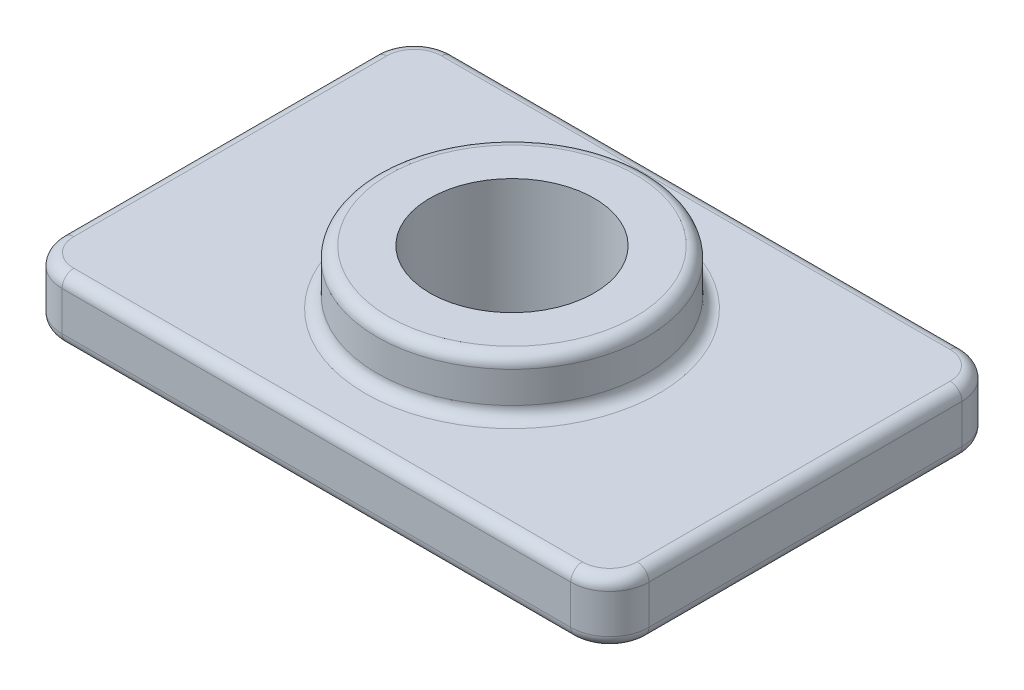
ISO-10303-21;
HEADER;
FILE_DESCRIPTION(('STEP AP214'),'2;1');
FILE_NAME('part.step','',(''),(''),'','','');
FILE_SCHEMA(('AUTOMOTIVE_DESIGN { 1 0 10303 214 1 1 1 1 }'));
ENDSEC;
DATA;
#1=APPLICATION_CONTEXT('core data for automotive mechanical design processes');
#2=APPLICATION_PROTOCOL_DEFINITION('international standard','automotive_design',2000,#1);
#3=PRODUCT_CONTEXT('',#1,'mechanical');
#4=PRODUCT('Part','Part','',(#3));
#5=PRODUCT_RELATED_PRODUCT_CATEGORY('part','',(#4));
#6=PRODUCT_DEFINITION_FORMATION('','',#4);
#7=PRODUCT_DEFINITION_CONTEXT('part definition',#1,'design');
#8=PRODUCT_DEFINITION('design','',#6,#7);
#9=PRODUCT_DEFINITION_SHAPE('','',#8);
#10=(LENGTH_UNIT() NAMED_UNIT(*) SI_UNIT(.MILLI.,.METRE.));
#11=(NAMED_UNIT(*) PLANE_ANGLE_UNIT() SI_UNIT($,.RADIAN.));
#12=(NAMED_UNIT(*) SI_UNIT($,.STERADIAN.) SOLID_ANGLE_UNIT());
#13=UNCERTAINTY_MEASURE_WITH_UNIT(LENGTH_MEASURE(1.E-05),#10,'distance_accuracy_value','');
#14=(GEOMETRIC_REPRESENTATION_CONTEXT(3) GLOBAL_UNCERTAINTY_ASSIGNED_CONTEXT((#13)) GLOBAL_UNIT_ASSIGNED_CONTEXT((#10,
#11,#12)) REPRESENTATION_CONTEXT('',''));
#15=CARTESIAN_POINT('',(0.,0.,0.));
#16=DIRECTION('',(0.,0.,1.));
#17=DIRECTION('',(1.,0.,0.));
#18=AXIS2_PLACEMENT_3D('',#15,#16,#17);
#19=CARTESIAN_POINT('',(1.,1.6,-1.));
#20=DIRECTION('',(0.,1.,0.));
#21=DIRECTION('',(0.,0.,1.));
#22=AXIS2_PLACEMENT_3D('',#19,#20,#21);
#23=PLANE('',#22);
#24=CARTESIAN_POINT('',(7.5,1.6,-5.));
#25=DIRECTION('',(0.,1.,0.));
#26=DIRECTION('',(0.,0.,1.));
#27=AXIS2_PLACEMENT_3D('',#24,#25,#26);
#28=CIRCLE('',#27,3.75);
#29=CARTESIAN_POINT('',(7.5,1.6,-1.25));
#30=VERTEX_POINT('',#29);
#31=EDGE_CURVE('E173',#30,#30,#28,.F.);
#32=ORIENTED_EDGE('',*,*,#31,.T.);
#33=EDGE_LOOP('',(#32));
#34=FACE_BOUND('',#33,.T.);
#35=DIRECTION('',(-1.,0.,0.));
#36=VECTOR('',#35,1.);
#37=CARTESIAN_POINT('',(1.,1.6,-9.7));
#38=LINE('',#37,#36);
#39=CARTESIAN_POINT('',(14.,1.6,-9.7));
#40=VERTEX_POINT('',#39);
#41=CARTESIAN_POINT('',(1.,1.6,-9.7));
#42=VERTEX_POINT('',#41);
#43=EDGE_CURVE('E171',#40,#42,#38,.T.);
#44=ORIENTED_EDGE('',*,*,#43,.T.);
#45=CARTESIAN_POINT('',(1.,1.6,-9.));
#46=DIRECTION('',(0.,1.,0.));
#47=DIRECTION('',(0.,0.,1.));
#48=AXIS2_PLACEMENT_3D('',#45,#46,#47);
#49=CIRCLE('',#48,0.7);
#50=CARTESIAN_POINT('',(0.3,1.6,-9.));
#51=VERTEX_POINT('',#50);
#52=EDGE_CURVE('E153',#42,#51,#49,.T.);
#53=ORIENTED_EDGE('',*,*,#52,.T.);
#54=DIRECTION('',(0.,0.,1.));
#55=VECTOR('',#54,1.);
#56=CARTESIAN_POINT('',(0.3,1.6,-1.));
#57=LINE('',#56,#55);
#58=CARTESIAN_POINT('',(0.3,1.6,-1.));
#59=VERTEX_POINT('',#58);
#60=EDGE_CURVE('E161',#51,#59,#57,.T.);
#61=ORIENTED_EDGE('',*,*,#60,.T.);
#62=CARTESIAN_POINT('',(1.,1.6,-1.));
#63=DIRECTION('',(0.,1.,0.));
#64=DIRECTION('',(0.,0.,1.));
#65=AXIS2_PLACEMENT_3D('',#62,#63,#64);
#66=CIRCLE('',#65,0.7);
#67=CARTESIAN_POINT('',(1.,1.6,-0.3));
#68=VERTEX_POINT('',#67);
#69=EDGE_CURVE('E167',#59,#68,#66,.T.);
#70=ORIENTED_EDGE('',*,*,#69,.T.);
#71=DIRECTION('',(1.,0.,0.));
#72=VECTOR('',#71,1.);
#73=CARTESIAN_POINT('',(14.,1.6,-0.3));
#74=LINE('',#73,#72);
#75=CARTESIAN_POINT('',(14.,1.6,-0.3));
#76=VERTEX_POINT('',#75);
#77=EDGE_CURVE('E324',#68,#76,#74,.T.);
#78=ORIENTED_EDGE('',*,*,#77,.T.);
#79=CARTESIAN_POINT('',(14.,1.6,-1.));
#80=DIRECTION('',(0.,1.,0.));
#81=DIRECTION('',(0.,0.,1.));
#82=AXIS2_PLACEMENT_3D('',#79,#80,#81);
#83=CIRCLE('',#82,0.700000000000001);
#84=CARTESIAN_POINT('',(14.7,1.6,-1.));
#85=VERTEX_POINT('',#84);
#86=EDGE_CURVE('E326',#76,#85,#83,.T.);
#87=ORIENTED_EDGE('',*,*,#86,.T.);
#88=DIRECTION('',(0.,0.,-1.));
#89=VECTOR('',#88,1.);
#90=CARTESIAN_POINT('',(14.7,1.6,-9.));
#91=LINE('',#90,#89);
#92=CARTESIAN_POINT('',(14.7,1.6,-9.));
#93=VERTEX_POINT('',#92);
#94=EDGE_CURVE('E328',#85,#93,#91,.T.);
#95=ORIENTED_EDGE('',*,*,#94,.T.);
#96=CARTESIAN_POINT('',(14.,1.6,-9.));
#97=DIRECTION('',(0.,1.,0.));
#98=DIRECTION('',(0.,0.,1.));
#99=AXIS2_PLACEMENT_3D('',#96,#97,#98);
#100=CIRCLE('',#99,0.7);
#101=EDGE_CURVE('E178',#93,#40,#100,.T.);
#102=ORIENTED_EDGE('',*,*,#101,.T.);
#103=EDGE_LOOP('',(#44,#53,#61,#70,#78,#87,#95,#102));
#104=FACE_BOUND('',#103,.T.);
#105=ADVANCED_FACE('F32',(#34,#104),#23,.T.);
#106=CARTESIAN_POINT('',(1.,1.6,-1.));
#107=DIRECTION('',(0.,-1.,0.));
#108=DIRECTION('',(0.,0.,-1.));
#109=AXIS2_PLACEMENT_3D('',#106,#107,#108);
#110=CYLINDRICAL_SURFACE('',#109,1.);
#111=DIRECTION('',(0.,-1.,0.));
#112=VECTOR('',#111,1.);
#113=CARTESIAN_POINT('',(1.,1.6,0.));
#114=LINE('',#113,#112);
#115=CARTESIAN_POINT('',(1.,1.3,0.));
#116=VERTEX_POINT('',#115);
#117=CARTESIAN_POINT('',(1.,0.3,0.));
#118=VERTEX_POINT('',#117);
#119=EDGE_CURVE('E168',#116,#118,#114,.T.);
#120=ORIENTED_EDGE('',*,*,#119,.F.);
#121=CARTESIAN_POINT('',(1.,1.3,-1.));
#122=DIRECTION('',(0.,1.,0.));
#123=DIRECTION('',(0.,0.,1.));
#124=AXIS2_PLACEMENT_3D('',#121,#122,#123);
#125=CIRCLE('',#124,1.);
#126=CARTESIAN_POINT('',(0.,1.3,-1.));
#127=VERTEX_POINT('',#126);
#128=EDGE_CURVE('E207',#116,#127,#125,.F.);
#129=ORIENTED_EDGE('',*,*,#128,.T.);
#130=DIRECTION('',(0.,-1.,0.));
#131=VECTOR('',#130,1.);
#132=CARTESIAN_POINT('',(0.,1.6,-1.));
#133=LINE('',#132,#131);
#134=CARTESIAN_POINT('',(0.,0.3,-1.));
#135=VERTEX_POINT('',#134);
#136=EDGE_CURVE('E309',#127,#135,#133,.T.);
#137=ORIENTED_EDGE('',*,*,#136,.T.);
#138=CARTESIAN_POINT('',(1.,0.3,-1.));
#139=DIRECTION('',(0.,1.,0.));
#140=DIRECTION('',(0.,0.,1.));
#141=AXIS2_PLACEMENT_3D('',#138,#139,#140);
#142=CIRCLE('',#141,1.);
#143=EDGE_CURVE('E205',#135,#118,#142,.T.);
#144=ORIENTED_EDGE('',*,*,#143,.T.);
#145=EDGE_LOOP('',(#120,#129,#137,#144));
#146=FACE_BOUND('',#145,.T.);
#147=ADVANCED_FACE('F378',(#146),#110,.T.);
#148=CARTESIAN_POINT('',(1.,1.6,0.));
#149=DIRECTION('',(0.,0.,-1.));
#150=DIRECTION('',(-1.,0.,0.));
#151=AXIS2_PLACEMENT_3D('',#148,#149,#150);
#152=PLANE('',#151);
#153=DIRECTION('',(0.,-1.,0.));
#154=VECTOR('',#153,1.);
#155=CARTESIAN_POINT('',(14.,1.6,0.));
#156=LINE('',#155,#154);
#157=CARTESIAN_POINT('',(14.,1.3,0.));
#158=VERTEX_POINT('',#157);
#159=CARTESIAN_POINT('',(14.,0.3,0.));
#160=VERTEX_POINT('',#159);
#161=EDGE_CURVE('E318',#158,#160,#156,.T.);
#162=ORIENTED_EDGE('',*,*,#161,.F.);
#163=DIRECTION('',(1.,0.,0.));
#164=VECTOR('',#163,1.);
#165=CARTESIAN_POINT('',(1.,1.3,0.));
#166=LINE('',#165,#164);
#167=EDGE_CURVE('E203',#158,#116,#166,.F.);
#168=ORIENTED_EDGE('',*,*,#167,.T.);
#169=ORIENTED_EDGE('',*,*,#119,.T.);
#170=DIRECTION('',(1.,0.,0.));
#171=VECTOR('',#170,1.);
#172=CARTESIAN_POINT('',(1.,0.3,0.));
#173=LINE('',#172,#171);
#174=EDGE_CURVE('E201',#118,#160,#173,.T.);
#175=ORIENTED_EDGE('',*,*,#174,.T.);
#176=EDGE_LOOP('',(#162,#168,#169,#175));
#177=FACE_BOUND('',#176,.T.);
#178=ADVANCED_FACE('F359',(#177),#152,.F.);
#179=CARTESIAN_POINT('',(14.,1.6,-1.));
#180=DIRECTION('',(0.,-1.,0.));
#181=DIRECTION('',(0.,0.,-1.));
#182=AXIS2_PLACEMENT_3D('',#179,#180,#181);
#183=CYLINDRICAL_SURFACE('',#182,1.);
#184=DIRECTION('',(0.,-1.,0.));
#185=VECTOR('',#184,1.);
#186=CARTESIAN_POINT('',(15.,1.6,-1.));
#187=LINE('',#186,#185);
#188=CARTESIAN_POINT('',(15.,1.3,-1.));
#189=VERTEX_POINT('',#188);
#190=CARTESIAN_POINT('',(15.,0.3,-1.));
#191=VERTEX_POINT('',#190);
#192=EDGE_CURVE('E315',#189,#191,#187,.T.);
#193=ORIENTED_EDGE('',*,*,#192,.F.);
#194=CARTESIAN_POINT('',(14.,1.3,-1.));
#195=DIRECTION('',(0.,1.,0.));
#196=DIRECTION('',(0.,0.,1.));
#197=AXIS2_PLACEMENT_3D('',#194,#195,#196);
#198=CIRCLE('',#197,1.);
#199=EDGE_CURVE('E199',#189,#158,#198,.F.);
#200=ORIENTED_EDGE('',*,*,#199,.T.);
#201=ORIENTED_EDGE('',*,*,#161,.T.);
#202=CARTESIAN_POINT('',(14.,0.3,-1.));
#203=DIRECTION('',(0.,1.,0.));
#204=DIRECTION('',(0.,0.,1.));
#205=AXIS2_PLACEMENT_3D('',#202,#203,#204);
#206=CIRCLE('',#205,1.);
#207=EDGE_CURVE('E197',#160,#191,#206,.T.);
#208=ORIENTED_EDGE('',*,*,#207,.T.);
#209=EDGE_LOOP('',(#193,#200,#201,#208));
#210=FACE_BOUND('',#209,.T.);
#211=ADVANCED_FACE('F357',(#210),#183,.T.);
#212=CARTESIAN_POINT('',(15.,1.6,-1.));
#213=DIRECTION('',(-1.,0.,0.));
#214=DIRECTION('',(0.,0.,1.));
#215=AXIS2_PLACEMENT_3D('',#212,#213,#214);
#216=PLANE('',#215);
#217=DIRECTION('',(0.,-1.,0.));
#218=VECTOR('',#217,1.);
#219=CARTESIAN_POINT('',(15.,1.6,-9.));
#220=LINE('',#219,#218);
#221=CARTESIAN_POINT('',(15.,1.3,-9.));
#222=VERTEX_POINT('',#221);
#223=CARTESIAN_POINT('',(15.,0.3,-9.));
#224=VERTEX_POINT('',#223);
#225=EDGE_CURVE('E307',#222,#224,#220,.T.);
#226=ORIENTED_EDGE('',*,*,#225,.F.);
#227=DIRECTION('',(0.,0.,-1.));
#228=VECTOR('',#227,1.);
#229=CARTESIAN_POINT('',(15.,1.3,-1.));
#230=LINE('',#229,#228);
#231=EDGE_CURVE('E195',#222,#189,#230,.F.);
#232=ORIENTED_EDGE('',*,*,#231,.T.);
#233=ORIENTED_EDGE('',*,*,#192,.T.);
#234=DIRECTION('',(0.,0.,-1.));
#235=VECTOR('',#234,1.);
#236=CARTESIAN_POINT('',(15.,0.3,-1.));
#237=LINE('',#236,#235);
#238=EDGE_CURVE('E193',#191,#224,#237,.T.);
#239=ORIENTED_EDGE('',*,*,#238,.T.);
#240=EDGE_LOOP('',(#226,#232,#233,#239));
#241=FACE_BOUND('',#240,.T.);
#242=ADVANCED_FACE('F344',(#241),#216,.F.);
#243=CARTESIAN_POINT('',(14.,1.6,-9.));
#244=DIRECTION('',(0.,-1.,0.));
#245=DIRECTION('',(0.,0.,-1.));
#246=AXIS2_PLACEMENT_3D('',#243,#244,#245);
#247=CYLINDRICAL_SURFACE('',#246,1.);
#248=DIRECTION('',(0.,-1.,0.));
#249=VECTOR('',#248,1.);
#250=CARTESIAN_POINT('',(14.,1.6,-10.));
#251=LINE('',#250,#249);
#252=CARTESIAN_POINT('',(14.,1.3,-10.));
#253=VERTEX_POINT('',#252);
#254=CARTESIAN_POINT('',(14.,0.3,-10.));
#255=VERTEX_POINT('',#254);
#256=EDGE_CURVE('E300',#253,#255,#251,.T.);
#257=ORIENTED_EDGE('',*,*,#256,.F.);
#258=CARTESIAN_POINT('',(14.,1.3,-9.));
#259=DIRECTION('',(0.,1.,0.));
#260=DIRECTION('',(0.,0.,1.));
#261=AXIS2_PLACEMENT_3D('',#258,#259,#260);
#262=CIRCLE('',#261,1.);
#263=EDGE_CURVE('E191',#253,#222,#262,.F.);
#264=ORIENTED_EDGE('',*,*,#263,.T.);
#265=ORIENTED_EDGE('',*,*,#225,.T.);
#266=CARTESIAN_POINT('',(14.,0.3,-9.));
#267=DIRECTION('',(0.,1.,0.));
#268=DIRECTION('',(0.,0.,1.));
#269=AXIS2_PLACEMENT_3D('',#266,#267,#268);
#270=CIRCLE('',#269,1.);
#271=EDGE_CURVE('E189',#224,#255,#270,.T.);
#272=ORIENTED_EDGE('',*,*,#271,.T.);
#273=EDGE_LOOP('',(#257,#264,#265,#272));
#274=FACE_BOUND('',#273,.T.);
#275=ADVANCED_FACE('F340',(#274),#247,.T.);
#276=CARTESIAN_POINT('',(1.,1.6,-10.));
#277=DIRECTION('',(0.,0.,1.));
#278=DIRECTION('',(1.,0.,0.));
#279=AXIS2_PLACEMENT_3D('',#276,#277,#278);
#280=PLANE('',#279);
#281=DIRECTION('',(0.,-1.,0.));
#282=VECTOR('',#281,1.);
#283=CARTESIAN_POINT('',(1.,1.6,-10.));
#284=LINE('',#283,#282);
#285=CARTESIAN_POINT('',(1.,1.3,-10.));
#286=VERTEX_POINT('',#285);
#287=CARTESIAN_POINT('',(1.,0.3,-10.));
#288=VERTEX_POINT('',#287);
#289=EDGE_CURVE('E298',#286,#288,#284,.T.);
#290=ORIENTED_EDGE('',*,*,#289,.F.);
#291=DIRECTION('',(-1.,0.,0.));
#292=VECTOR('',#291,1.);
#293=CARTESIAN_POINT('',(14.,1.3,-10.));
#294=LINE('',#293,#292);
#295=EDGE_CURVE('E187',#286,#253,#294,.F.);
#296=ORIENTED_EDGE('',*,*,#295,.T.);
#297=ORIENTED_EDGE('',*,*,#256,.T.);
#298=DIRECTION('',(-1.,0.,0.));
#299=VECTOR('',#298,1.);
#300=CARTESIAN_POINT('',(1.,0.3,-10.));
#301=LINE('',#300,#299);
#302=EDGE_CURVE('E185',#255,#288,#301,.T.);
#303=ORIENTED_EDGE('',*,*,#302,.T.);
#304=EDGE_LOOP('',(#290,#296,#297,#303));
#305=FACE_BOUND('',#304,.T.);
#306=ADVANCED_FACE('F297',(#305),#280,.F.);
#307=CARTESIAN_POINT('',(1.,1.6,-9.));
#308=DIRECTION('',(0.,-1.,0.));
#309=DIRECTION('',(0.,0.,-1.));
#310=AXIS2_PLACEMENT_3D('',#307,#308,#309);
#311=CYLINDRICAL_SURFACE('',#310,1.);
#312=DIRECTION('',(0.,-1.,0.));
#313=VECTOR('',#312,1.);
#314=CARTESIAN_POINT('',(0.,1.6,-9.));
#315=LINE('',#314,#313);
#316=CARTESIAN_POINT('',(0.,1.3,-9.));
#317=VERTEX_POINT('',#316);
#318=CARTESIAN_POINT('',(0.,0.3,-9.));
#319=VERTEX_POINT('',#318);
#320=EDGE_CURVE('E305',#317,#319,#315,.T.);
#321=ORIENTED_EDGE('',*,*,#320,.F.);
#322=CARTESIAN_POINT('',(1.,1.3,-9.));
#323=DIRECTION('',(0.,1.,0.));
#324=DIRECTION('',(0.,0.,1.));
#325=AXIS2_PLACEMENT_3D('',#322,#323,#324);
#326=CIRCLE('',#325,1.);
#327=EDGE_CURVE('E155',#317,#286,#326,.F.);
#328=ORIENTED_EDGE('',*,*,#327,.T.);
#329=ORIENTED_EDGE('',*,*,#289,.T.);
#330=CARTESIAN_POINT('',(1.,0.3,-9.));
#331=DIRECTION('',(0.,1.,0.));
#332=DIRECTION('',(0.,0.,1.));
#333=AXIS2_PLACEMENT_3D('',#330,#331,#332);
#334=CIRCLE('',#333,1.);
#335=EDGE_CURVE('E176',#288,#319,#334,.T.);
#336=ORIENTED_EDGE('',*,*,#335,.T.);
#337=EDGE_LOOP('',(#321,#328,#329,#336));
#338=FACE_BOUND('',#337,.T.);
#339=ADVANCED_FACE('F303',(#338),#311,.T.);
#340=CARTESIAN_POINT('',(0.,1.6,-1.));
#341=DIRECTION('',(1.,0.,0.));
#342=DIRECTION('',(0.,0.,-1.));
#343=AXIS2_PLACEMENT_3D('',#340,#341,#342);
#344=PLANE('',#343);
#345=ORIENTED_EDGE('',*,*,#136,.F.);
#346=DIRECTION('',(0.,0.,1.));
#347=VECTOR('',#346,1.);
#348=CARTESIAN_POINT('',(0.,1.3,-9.));
#349=LINE('',#348,#347);
#350=EDGE_CURVE('E11',#127,#317,#349,.F.);
#351=ORIENTED_EDGE('',*,*,#350,.T.);
#352=ORIENTED_EDGE('',*,*,#320,.T.);
#353=DIRECTION('',(0.,0.,1.));
#354=VECTOR('',#353,1.);
#355=CARTESIAN_POINT('',(0.,0.3,-1.));
#356=LINE('',#355,#354);
#357=EDGE_CURVE('E41',#319,#135,#356,.T.);
#358=ORIENTED_EDGE('',*,*,#357,.T.);
#359=EDGE_LOOP('',(#345,#351,#352,#358));
#360=FACE_BOUND('',#359,.T.);
#361=ADVANCED_FACE('F376',(#360),#344,.F.);
#362=CARTESIAN_POINT('',(1.,0.,-1.));
#363=DIRECTION('',(0.,1.,0.));
#364=DIRECTION('',(0.,0.,1.));
#365=AXIS2_PLACEMENT_3D('',#362,#363,#364);
#366=PLANE('',#365);
#367=DIRECTION('',(0.,0.,1.));
#368=VECTOR('',#367,1.);
#369=CARTESIAN_POINT('',(0.3,0.,-1.));
#370=LINE('',#369,#368);
#371=CARTESIAN_POINT('',(0.3,0.,-1.));
#372=VERTEX_POINT('',#371);
#373=CARTESIAN_POINT('',(0.3,0.,-9.));
#374=VERTEX_POINT('',#373);
#375=EDGE_CURVE('E209',#372,#374,#370,.F.);
#376=ORIENTED_EDGE('',*,*,#375,.T.);
#377=CARTESIAN_POINT('',(1.,0.,-9.));
#378=DIRECTION('',(0.,1.,0.));
#379=DIRECTION('',(0.,0.,1.));
#380=AXIS2_PLACEMENT_3D('',#377,#378,#379);
#381=CIRCLE('',#380,0.7);
#382=CARTESIAN_POINT('',(1.,0.,-9.7));
#383=VERTEX_POINT('',#382);
#384=EDGE_CURVE('E222',#374,#383,#381,.F.);
#385=ORIENTED_EDGE('',*,*,#384,.T.);
#386=DIRECTION('',(-1.,0.,0.));
#387=VECTOR('',#386,1.);
#388=CARTESIAN_POINT('',(1.,0.,-9.7));
#389=LINE('',#388,#387);
#390=CARTESIAN_POINT('',(14.,0.,-9.7));
#391=VERTEX_POINT('',#390);
#392=EDGE_CURVE('E56',#383,#391,#389,.F.);
#393=ORIENTED_EDGE('',*,*,#392,.T.);
#394=CARTESIAN_POINT('',(14.,0.,-9.));
#395=DIRECTION('',(0.,1.,0.));
#396=DIRECTION('',(0.,0.,1.));
#397=AXIS2_PLACEMENT_3D('',#394,#395,#396);
#398=CIRCLE('',#397,0.7);
#399=CARTESIAN_POINT('',(14.7,0.,-9.));
#400=VERTEX_POINT('',#399);
#401=EDGE_CURVE('E219',#391,#400,#398,.F.);
#402=ORIENTED_EDGE('',*,*,#401,.T.);
#403=DIRECTION('',(0.,0.,-1.));
#404=VECTOR('',#403,1.);
#405=CARTESIAN_POINT('',(14.7,0.,-1.));
#406=LINE('',#405,#404);
#407=CARTESIAN_POINT('',(14.7,0.,-1.));
#408=VERTEX_POINT('',#407);
#409=EDGE_CURVE('E217',#400,#408,#406,.F.);
#410=ORIENTED_EDGE('',*,*,#409,.T.);
#411=CARTESIAN_POINT('',(14.,0.,-1.));
#412=DIRECTION('',(0.,1.,0.));
#413=DIRECTION('',(0.,0.,1.));
#414=AXIS2_PLACEMENT_3D('',#411,#412,#413);
#415=CIRCLE('',#414,0.700000000000001);
#416=CARTESIAN_POINT('',(14.,0.,-0.3));
#417=VERTEX_POINT('',#416);
#418=EDGE_CURVE('E215',#408,#417,#415,.F.);
#419=ORIENTED_EDGE('',*,*,#418,.T.);
#420=DIRECTION('',(1.,0.,0.));
#421=VECTOR('',#420,1.);
#422=CARTESIAN_POINT('',(1.,0.,-0.3));
#423=LINE('',#422,#421);
#424=CARTESIAN_POINT('',(1.,0.,-0.3));
#425=VERTEX_POINT('',#424);
#426=EDGE_CURVE('E213',#417,#425,#423,.F.);
#427=ORIENTED_EDGE('',*,*,#426,.T.);
#428=CARTESIAN_POINT('',(1.,0.,-1.));
#429=DIRECTION('',(0.,1.,0.));
#430=DIRECTION('',(0.,0.,1.));
#431=AXIS2_PLACEMENT_3D('',#428,#429,#430);
#432=CIRCLE('',#431,0.7);
#433=EDGE_CURVE('E211',#425,#372,#432,.F.);
#434=ORIENTED_EDGE('',*,*,#433,.T.);
#435=EDGE_LOOP('',(#376,#385,#393,#402,#410,#419,#427,#434));
#436=FACE_BOUND('',#435,.T.);
#437=CARTESIAN_POINT('',(7.5,0.,-5.));
#438=DIRECTION('',(0.,1.,0.));
#439=DIRECTION('',(0.,0.,1.));
#440=AXIS2_PLACEMENT_3D('',#437,#438,#439);
#441=CIRCLE('',#440,2.1);
#442=CARTESIAN_POINT('',(7.5,0.,-2.9));
#443=VERTEX_POINT('',#442);
#444=EDGE_CURVE('E380',#443,#443,#441,.T.);
#445=ORIENTED_EDGE('',*,*,#444,.T.);
#446=EDGE_LOOP('',(#445));
#447=FACE_BOUND('',#446,.T.);
#448=ADVANCED_FACE('F283',(#436,#447),#366,.F.);
#449=CARTESIAN_POINT('',(7.5,3.,-5.));
#450=DIRECTION('',(0.,-1.,0.));
#451=DIRECTION('',(0.,0.,-1.));
#452=AXIS2_PLACEMENT_3D('',#449,#450,#451);
#453=CYLINDRICAL_SURFACE('',#452,3.45);
#454=CARTESIAN_POINT('',(7.5,2.7,-5.));
#455=DIRECTION('',(0.,1.,0.));
#456=DIRECTION('',(0.,0.,1.));
#457=AXIS2_PLACEMENT_3D('',#454,#455,#456);
#458=CIRCLE('',#457,3.45);
#459=CARTESIAN_POINT('',(7.5,2.7,-1.55));
#460=VERTEX_POINT('',#459);
#461=EDGE_CURVE('E230',#460,#460,#458,.F.);
#462=ORIENTED_EDGE('',*,*,#461,.T.);
#463=EDGE_LOOP('',(#462));
#464=FACE_BOUND('',#463,.T.);
#465=CARTESIAN_POINT('',(7.5,1.9,-5.));
#466=DIRECTION('',(0.,1.,0.));
#467=DIRECTION('',(0.,0.,1.));
#468=AXIS2_PLACEMENT_3D('',#465,#466,#467);
#469=CIRCLE('',#468,3.45);
#470=CARTESIAN_POINT('',(7.5,1.9,-1.55));
#471=VERTEX_POINT('',#470);
#472=EDGE_CURVE('E227',#471,#471,#469,.T.);
#473=ORIENTED_EDGE('',*,*,#472,.T.);
#474=EDGE_LOOP('',(#473));
#475=FACE_BOUND('',#474,.T.);
#476=ADVANCED_FACE('F391',(#464,#475),#453,.T.);
#477=CARTESIAN_POINT('',(7.5,3.,-5.));
#478=DIRECTION('',(0.,1.,0.));
#479=DIRECTION('',(0.,0.,1.));
#480=AXIS2_PLACEMENT_3D('',#477,#478,#479);
#481=PLANE('',#480);
#482=CARTESIAN_POINT('',(7.5,3.,-5.));
#483=DIRECTION('',(0.,1.,0.));
#484=DIRECTION('',(0.,0.,1.));
#485=AXIS2_PLACEMENT_3D('',#482,#483,#484);
#486=CIRCLE('',#485,3.15);
#487=CARTESIAN_POINT('',(7.5,3.,-1.85));
#488=VERTEX_POINT('',#487);
#489=EDGE_CURVE('E224',#488,#488,#486,.T.);
#490=ORIENTED_EDGE('',*,*,#489,.T.);
#491=EDGE_LOOP('',(#490));
#492=FACE_BOUND('',#491,.T.);
#493=CARTESIAN_POINT('',(7.5,3.,-5.));
#494=DIRECTION('',(0.,1.,0.));
#495=DIRECTION('',(0.,0.,1.));
#496=AXIS2_PLACEMENT_3D('',#493,#494,#495);
#497=CIRCLE('',#496,2.1);
#498=CARTESIAN_POINT('',(7.5,3.,-2.9));
#499=VERTEX_POINT('',#498);
#500=EDGE_CURVE('E251',#499,#499,#497,.T.);
#501=ORIENTED_EDGE('',*,*,#500,.F.);
#502=EDGE_LOOP('',(#501));
#503=FACE_BOUND('',#502,.T.);
#504=ADVANCED_FACE('F389',(#492,#503),#481,.T.);
#505=CARTESIAN_POINT('',(7.5,3.,-5.));
#506=DIRECTION('',(0.,1.,0.));
#507=DIRECTION('',(0.,0.,1.));
#508=AXIS2_PLACEMENT_3D('',#505,#506,#507);
#509=CYLINDRICAL_SURFACE('',#508,2.1);
#510=ORIENTED_EDGE('',*,*,#444,.F.);
#511=EDGE_LOOP('',(#510));
#512=FACE_BOUND('',#511,.T.);
#513=ORIENTED_EDGE('',*,*,#500,.T.);
#514=EDGE_LOOP('',(#513));
#515=FACE_BOUND('',#514,.T.);
#516=ADVANCED_FACE('F387',(#512,#515),#509,.F.);
#517=CARTESIAN_POINT('',(14.,1.3,-1.));
#518=DIRECTION('',(0.,1.,0.));
#519=DIRECTION('',(0.,0.,1.));
#520=AXIS2_PLACEMENT_3D('',#517,#518,#519);
#521=TOROIDAL_SURFACE('',#520,0.700000000000001,0.3);
#522=CARTESIAN_POINT('',(14.,1.3,-0.3));
#523=DIRECTION('',(-1.,0.,0.));
#524=DIRECTION('',(0.,0.,1.));
#525=AXIS2_PLACEMENT_3D('',#522,#523,#524);
#526=CIRCLE('',#525,0.3);
#527=EDGE_CURVE('E245',#158,#76,#526,.T.);
#528=ORIENTED_EDGE('',*,*,#527,.F.);
#529=ORIENTED_EDGE('',*,*,#199,.F.);
#530=CARTESIAN_POINT('',(14.7,1.3,-1.));
#531=DIRECTION('',(0.,0.,-1.));
#532=DIRECTION('',(-1.,0.,0.));
#533=AXIS2_PLACEMENT_3D('',#530,#531,#532);
#534=CIRCLE('',#533,0.3);
#535=EDGE_CURVE('E248',#85,#189,#534,.T.);
#536=ORIENTED_EDGE('',*,*,#535,.F.);
#537=ORIENTED_EDGE('',*,*,#86,.F.);
#538=EDGE_LOOP('',(#528,#529,#536,#537));
#539=FACE_BOUND('',#538,.T.);
#540=ADVANCED_FACE('F353',(#539),#521,.T.);
#541=CARTESIAN_POINT('',(14.7,1.3,-1.));
#542=DIRECTION('',(0.,0.,1.));
#543=DIRECTION('',(1.,0.,0.));
#544=AXIS2_PLACEMENT_3D('',#541,#542,#543);
#545=CYLINDRICAL_SURFACE('',#544,0.3);
#546=ORIENTED_EDGE('',*,*,#535,.T.);
#547=ORIENTED_EDGE('',*,*,#231,.F.);
#548=CARTESIAN_POINT('',(14.7,1.3,-9.));
#549=DIRECTION('',(0.,0.,-1.));
#550=DIRECTION('',(-1.,0.,0.));
#551=AXIS2_PLACEMENT_3D('',#548,#549,#550);
#552=CIRCLE('',#551,0.3);
#553=EDGE_CURVE('E242',#93,#222,#552,.T.);
#554=ORIENTED_EDGE('',*,*,#553,.F.);
#555=ORIENTED_EDGE('',*,*,#94,.F.);
#556=EDGE_LOOP('',(#546,#547,#554,#555));
#557=FACE_BOUND('',#556,.T.);
#558=ADVANCED_FACE('F347',(#557),#545,.T.);
#559=CARTESIAN_POINT('',(1.,1.3,-0.3));
#560=DIRECTION('',(-1.,0.,0.));
#561=DIRECTION('',(0.,0.,1.));
#562=AXIS2_PLACEMENT_3D('',#559,#560,#561);
#563=CYLINDRICAL_SURFACE('',#562,0.3);
#564=ORIENTED_EDGE('',*,*,#527,.T.);
#565=ORIENTED_EDGE('',*,*,#77,.F.);
#566=CARTESIAN_POINT('',(1.,1.3,-0.3));
#567=DIRECTION('',(-1.,0.,0.));
#568=DIRECTION('',(0.,0.,1.));
#569=AXIS2_PLACEMENT_3D('',#566,#567,#568);
#570=CIRCLE('',#569,0.3);
#571=EDGE_CURVE('E239',#116,#68,#570,.T.);
#572=ORIENTED_EDGE('',*,*,#571,.F.);
#573=ORIENTED_EDGE('',*,*,#167,.F.);
#574=EDGE_LOOP('',(#564,#565,#572,#573));
#575=FACE_BOUND('',#574,.T.);
#576=ADVANCED_FACE('F438',(#575),#563,.T.);
#577=CARTESIAN_POINT('',(14.,1.3,-9.));
#578=DIRECTION('',(0.,1.,0.));
#579=DIRECTION('',(0.,0.,1.));
#580=AXIS2_PLACEMENT_3D('',#577,#578,#579);
#581=TOROIDAL_SURFACE('',#580,0.7,0.3);
#582=ORIENTED_EDGE('',*,*,#553,.T.);
#583=ORIENTED_EDGE('',*,*,#263,.F.);
#584=CARTESIAN_POINT('',(14.,1.3,-9.7));
#585=DIRECTION('',(-1.,0.,0.));
#586=DIRECTION('',(0.,0.,1.));
#587=AXIS2_PLACEMENT_3D('',#584,#585,#586);
#588=CIRCLE('',#587,0.3);
#589=EDGE_CURVE('E236',#40,#253,#588,.T.);
#590=ORIENTED_EDGE('',*,*,#589,.F.);
#591=ORIENTED_EDGE('',*,*,#101,.F.);
#592=EDGE_LOOP('',(#582,#583,#590,#591));
#593=FACE_BOUND('',#592,.T.);
#594=ADVANCED_FACE('F335',(#593),#581,.T.);
#595=CARTESIAN_POINT('',(1.,1.3,-1.));
#596=DIRECTION('',(0.,1.,0.));
#597=DIRECTION('',(0.,0.,1.));
#598=AXIS2_PLACEMENT_3D('',#595,#596,#597);
#599=TOROIDAL_SURFACE('',#598,0.7,0.3);
#600=ORIENTED_EDGE('',*,*,#571,.T.);
#601=ORIENTED_EDGE('',*,*,#69,.F.);
#602=CARTESIAN_POINT('',(0.3,1.3,-1.));
#603=DIRECTION('',(0.,0.,-1.));
#604=DIRECTION('',(-1.,0.,0.));
#605=AXIS2_PLACEMENT_3D('',#602,#603,#604);
#606=CIRCLE('',#605,0.3);
#607=EDGE_CURVE('E164',#127,#59,#606,.T.);
#608=ORIENTED_EDGE('',*,*,#607,.F.);
#609=ORIENTED_EDGE('',*,*,#128,.F.);
#610=EDGE_LOOP('',(#600,#601,#608,#609));
#611=FACE_BOUND('',#610,.T.);
#612=ADVANCED_FACE('F432',(#611),#599,.T.);
#613=CARTESIAN_POINT('',(1.,1.3,-9.7));
#614=DIRECTION('',(1.,0.,0.));
#615=DIRECTION('',(0.,0.,-1.));
#616=AXIS2_PLACEMENT_3D('',#613,#614,#615);
#617=CYLINDRICAL_SURFACE('',#616,0.3);
#618=ORIENTED_EDGE('',*,*,#589,.T.);
#619=ORIENTED_EDGE('',*,*,#295,.F.);
#620=CARTESIAN_POINT('',(1.,1.3,-9.7));
#621=DIRECTION('',(-1.,0.,0.));
#622=DIRECTION('',(0.,0.,1.));
#623=AXIS2_PLACEMENT_3D('',#620,#621,#622);
#624=CIRCLE('',#623,0.3);
#625=EDGE_CURVE('E158',#42,#286,#624,.T.);
#626=ORIENTED_EDGE('',*,*,#625,.F.);
#627=ORIENTED_EDGE('',*,*,#43,.F.);
#628=EDGE_LOOP('',(#618,#619,#626,#627));
#629=FACE_BOUND('',#628,.T.);
#630=ADVANCED_FACE('F338',(#629),#617,.T.);
#631=CARTESIAN_POINT('',(0.3,1.3,-1.));
#632=DIRECTION('',(0.,0.,-1.));
#633=DIRECTION('',(-1.,0.,0.));
#634=AXIS2_PLACEMENT_3D('',#631,#632,#633);
#635=CYLINDRICAL_SURFACE('',#634,0.3);
#636=ORIENTED_EDGE('',*,*,#607,.T.);
#637=ORIENTED_EDGE('',*,*,#60,.F.);
#638=CARTESIAN_POINT('',(0.3,1.3,-9.));
#639=DIRECTION('',(0.,0.,-1.));
#640=DIRECTION('',(-1.,0.,0.));
#641=AXIS2_PLACEMENT_3D('',#638,#639,#640);
#642=CIRCLE('',#641,0.3);
#643=EDGE_CURVE('E149',#317,#51,#642,.T.);
#644=ORIENTED_EDGE('',*,*,#643,.F.);
#645=ORIENTED_EDGE('',*,*,#350,.F.);
#646=EDGE_LOOP('',(#636,#637,#644,#645));
#647=FACE_BOUND('',#646,.T.);
#648=ADVANCED_FACE('F162',(#647),#635,.T.);
#649=CARTESIAN_POINT('',(1.,1.3,-9.));
#650=DIRECTION('',(0.,1.,0.));
#651=DIRECTION('',(0.,0.,1.));
#652=AXIS2_PLACEMENT_3D('',#649,#650,#651);
#653=TOROIDAL_SURFACE('',#652,0.7,0.3);
#654=ORIENTED_EDGE('',*,*,#625,.T.);
#655=ORIENTED_EDGE('',*,*,#327,.F.);
#656=ORIENTED_EDGE('',*,*,#643,.T.);
#657=ORIENTED_EDGE('',*,*,#52,.F.);
#658=EDGE_LOOP('',(#654,#655,#656,#657));
#659=FACE_BOUND('',#658,.T.);
#660=ADVANCED_FACE('F151',(#659),#653,.T.);
#661=CARTESIAN_POINT('',(14.,0.3,-1.));
#662=DIRECTION('',(0.,1.,0.));
#663=DIRECTION('',(0.,0.,1.));
#664=AXIS2_PLACEMENT_3D('',#661,#662,#663);
#665=TOROIDAL_SURFACE('',#664,0.700000000000001,0.3);
#666=CARTESIAN_POINT('',(14.,0.3,-0.3));
#667=DIRECTION('',(-1.,0.,0.));
#668=DIRECTION('',(0.,0.,1.));
#669=AXIS2_PLACEMENT_3D('',#666,#667,#668);
#670=CIRCLE('',#669,0.3);
#671=EDGE_CURVE('E266',#417,#160,#670,.T.);
#672=ORIENTED_EDGE('',*,*,#671,.F.);
#673=ORIENTED_EDGE('',*,*,#418,.F.);
#674=CARTESIAN_POINT('',(14.7,0.3,-1.));
#675=DIRECTION('',(0.,0.,-1.));
#676=DIRECTION('',(-1.,0.,0.));
#677=AXIS2_PLACEMENT_3D('',#674,#675,#676);
#678=CIRCLE('',#677,0.3);
#679=EDGE_CURVE('E36',#191,#408,#678,.T.);
#680=ORIENTED_EDGE('',*,*,#679,.F.);
#681=ORIENTED_EDGE('',*,*,#207,.F.);
#682=EDGE_LOOP('',(#672,#673,#680,#681));
#683=FACE_BOUND('',#682,.T.);
#684=ADVANCED_FACE('F282',(#683),#665,.T.);
#685=CARTESIAN_POINT('',(14.7,0.3,-1.));
#686=DIRECTION('',(0.,0.,-1.));
#687=DIRECTION('',(-1.,0.,0.));
#688=AXIS2_PLACEMENT_3D('',#685,#686,#687);
#689=CYLINDRICAL_SURFACE('',#688,0.3);
#690=ORIENTED_EDGE('',*,*,#679,.T.);
#691=ORIENTED_EDGE('',*,*,#409,.F.);
#692=CARTESIAN_POINT('',(14.7,0.3,-9.));
#693=DIRECTION('',(0.,0.,-1.));
#694=DIRECTION('',(-1.,0.,0.));
#695=AXIS2_PLACEMENT_3D('',#692,#693,#694);
#696=CIRCLE('',#695,0.3);
#697=EDGE_CURVE('E264',#224,#400,#696,.T.);
#698=ORIENTED_EDGE('',*,*,#697,.F.);
#699=ORIENTED_EDGE('',*,*,#238,.F.);
#700=EDGE_LOOP('',(#690,#691,#698,#699));
#701=FACE_BOUND('',#700,.T.);
#702=ADVANCED_FACE('F277',(#701),#689,.T.);
#703=CARTESIAN_POINT('',(1.,0.3,-0.3));
#704=DIRECTION('',(1.,0.,0.));
#705=DIRECTION('',(0.,0.,-1.));
#706=AXIS2_PLACEMENT_3D('',#703,#704,#705);
#707=CYLINDRICAL_SURFACE('',#706,0.3);
#708=ORIENTED_EDGE('',*,*,#671,.T.);
#709=ORIENTED_EDGE('',*,*,#174,.F.);
#710=CARTESIAN_POINT('',(1.,0.3,-0.3));
#711=DIRECTION('',(-1.,0.,0.));
#712=DIRECTION('',(0.,0.,1.));
#713=AXIS2_PLACEMENT_3D('',#710,#711,#712);
#714=CIRCLE('',#713,0.3);
#715=EDGE_CURVE('E261',#425,#118,#714,.T.);
#716=ORIENTED_EDGE('',*,*,#715,.F.);
#717=ORIENTED_EDGE('',*,*,#426,.F.);
#718=EDGE_LOOP('',(#708,#709,#716,#717));
#719=FACE_BOUND('',#718,.T.);
#720=ADVANCED_FACE('F361',(#719),#707,.T.);
#721=CARTESIAN_POINT('',(14.,0.3,-9.));
#722=DIRECTION('',(0.,1.,0.));
#723=DIRECTION('',(0.,0.,1.));
#724=AXIS2_PLACEMENT_3D('',#721,#722,#723);
#725=TOROIDAL_SURFACE('',#724,0.7,0.3);
#726=ORIENTED_EDGE('',*,*,#697,.T.);
#727=ORIENTED_EDGE('',*,*,#401,.F.);
#728=CARTESIAN_POINT('',(14.,0.3,-9.7));
#729=DIRECTION('',(-1.,0.,0.));
#730=DIRECTION('',(0.,0.,1.));
#731=AXIS2_PLACEMENT_3D('',#728,#729,#730);
#732=CIRCLE('',#731,0.3);
#733=EDGE_CURVE('E258',#255,#391,#732,.T.);
#734=ORIENTED_EDGE('',*,*,#733,.F.);
#735=ORIENTED_EDGE('',*,*,#271,.F.);
#736=EDGE_LOOP('',(#726,#727,#734,#735));
#737=FACE_BOUND('',#736,.T.);
#738=ADVANCED_FACE('F288',(#737),#725,.T.);
#739=CARTESIAN_POINT('',(1.,0.3,-1.));
#740=DIRECTION('',(0.,1.,0.));
#741=DIRECTION('',(0.,0.,1.));
#742=AXIS2_PLACEMENT_3D('',#739,#740,#741);
#743=TOROIDAL_SURFACE('',#742,0.7,0.3);
#744=ORIENTED_EDGE('',*,*,#715,.T.);
#745=ORIENTED_EDGE('',*,*,#143,.F.);
#746=CARTESIAN_POINT('',(0.3,0.3,-1.));
#747=DIRECTION('',(0.,0.,-1.));
#748=DIRECTION('',(-1.,0.,0.));
#749=AXIS2_PLACEMENT_3D('',#746,#747,#748);
#750=CIRCLE('',#749,0.3);
#751=EDGE_CURVE('E255',#372,#135,#750,.T.);
#752=ORIENTED_EDGE('',*,*,#751,.F.);
#753=ORIENTED_EDGE('',*,*,#433,.F.);
#754=EDGE_LOOP('',(#744,#745,#752,#753));
#755=FACE_BOUND('',#754,.T.);
#756=ADVANCED_FACE('F365',(#755),#743,.T.);
#757=CARTESIAN_POINT('',(1.,0.3,-9.7));
#758=DIRECTION('',(-1.,0.,0.));
#759=DIRECTION('',(0.,0.,1.));
#760=AXIS2_PLACEMENT_3D('',#757,#758,#759);
#761=CYLINDRICAL_SURFACE('',#760,0.3);
#762=ORIENTED_EDGE('',*,*,#733,.T.);
#763=ORIENTED_EDGE('',*,*,#392,.F.);
#764=CARTESIAN_POINT('',(1.,0.3,-9.7));
#765=DIRECTION('',(-1.,0.,0.));
#766=DIRECTION('',(0.,0.,1.));
#767=AXIS2_PLACEMENT_3D('',#764,#765,#766);
#768=CIRCLE('',#767,0.3);
#769=EDGE_CURVE('E49',#288,#383,#768,.T.);
#770=ORIENTED_EDGE('',*,*,#769,.F.);
#771=ORIENTED_EDGE('',*,*,#302,.F.);
#772=EDGE_LOOP('',(#762,#763,#770,#771));
#773=FACE_BOUND('',#772,.T.);
#774=ADVANCED_FACE('F292',(#773),#761,.T.);
#775=CARTESIAN_POINT('',(0.3,0.3,-1.));
#776=DIRECTION('',(0.,0.,1.));
#777=DIRECTION('',(1.,0.,0.));
#778=AXIS2_PLACEMENT_3D('',#775,#776,#777);
#779=CYLINDRICAL_SURFACE('',#778,0.3);
#780=ORIENTED_EDGE('',*,*,#751,.T.);
#781=ORIENTED_EDGE('',*,*,#357,.F.);
#782=CARTESIAN_POINT('',(0.3,0.3,-9.));
#783=DIRECTION('',(0.,0.,-1.));
#784=DIRECTION('',(-1.,0.,0.));
#785=AXIS2_PLACEMENT_3D('',#782,#783,#784);
#786=CIRCLE('',#785,0.3);
#787=EDGE_CURVE('E252',#374,#319,#786,.T.);
#788=ORIENTED_EDGE('',*,*,#787,.F.);
#789=ORIENTED_EDGE('',*,*,#375,.F.);
#790=EDGE_LOOP('',(#780,#781,#788,#789));
#791=FACE_BOUND('',#790,.T.);
#792=ADVANCED_FACE('F372',(#791),#779,.T.);
#793=CARTESIAN_POINT('',(1.,0.3,-9.));
#794=DIRECTION('',(0.,1.,0.));
#795=DIRECTION('',(0.,0.,1.));
#796=AXIS2_PLACEMENT_3D('',#793,#794,#795);
#797=TOROIDAL_SURFACE('',#796,0.7,0.3);
#798=ORIENTED_EDGE('',*,*,#769,.T.);
#799=ORIENTED_EDGE('',*,*,#384,.F.);
#800=ORIENTED_EDGE('',*,*,#787,.T.);
#801=ORIENTED_EDGE('',*,*,#335,.F.);
#802=EDGE_LOOP('',(#798,#799,#800,#801));
#803=FACE_BOUND('',#802,.T.);
#804=ADVANCED_FACE('F370',(#803),#797,.T.);
#805=CARTESIAN_POINT('',(7.5,2.7,-5.));
#806=DIRECTION('',(0.,1.,0.));
#807=DIRECTION('',(0.,0.,1.));
#808=AXIS2_PLACEMENT_3D('',#805,#806,#807);
#809=TOROIDAL_SURFACE('',#808,3.15,0.3);
#810=ORIENTED_EDGE('',*,*,#461,.F.);
#811=EDGE_LOOP('',(#810));
#812=FACE_BOUND('',#811,.T.);
#813=ORIENTED_EDGE('',*,*,#489,.F.);
#814=EDGE_LOOP('',(#813));
#815=FACE_BOUND('',#814,.T.);
#816=ADVANCED_FACE('F448',(#812,#815),#809,.T.);
#817=CARTESIAN_POINT('',(7.5,1.9,-5.));
#818=DIRECTION('',(0.,1.,0.));
#819=DIRECTION('',(0.,0.,1.));
#820=AXIS2_PLACEMENT_3D('',#817,#818,#819);
#821=TOROIDAL_SURFACE('',#820,3.75,0.3);
#822=ORIENTED_EDGE('',*,*,#31,.F.);
#823=EDGE_LOOP('',(#822));
#824=FACE_BOUND('',#823,.T.);
#825=ORIENTED_EDGE('',*,*,#472,.F.);
#826=EDGE_LOOP('',(#825));
#827=FACE_BOUND('',#826,.T.);
#828=ADVANCED_FACE('F34',(#824,#827),#821,.F.);
#829=CLOSED_SHELL('',(#105,#147,#178,#211,#242,#275,#306,#339,#361,#448,#476,#504,#516,#540,
#558,#576,#594,#612,#630,#648,#660,#684,#702,#720,#738,#756,#774,#792,#804,#816,#828));
#830=MANIFOLD_SOLID_BREP('B2',#829);
#831=ADVANCED_BREP_SHAPE_REPRESENTATION('',(#18,#830),#14);
#832=SHAPE_DEFINITION_REPRESENTATION(#9,#831);
ENDSEC;
END-ISO-10303-21;
